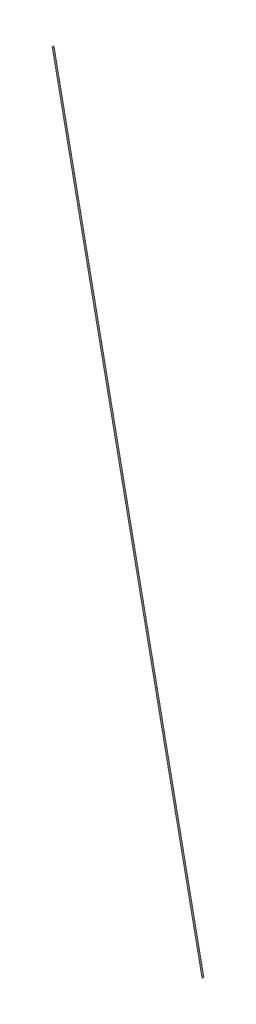
ISO-10303-21;
HEADER;
FILE_DESCRIPTION(('STEP AP214'),'2;1');
FILE_NAME('part.step','',(''),(''),'','','');
FILE_SCHEMA(('AUTOMOTIVE_DESIGN { 1 0 10303 214 1 1 1 1 }'));
ENDSEC;
DATA;
#1=APPLICATION_CONTEXT('core data for automotive mechanical design processes');
#2=APPLICATION_PROTOCOL_DEFINITION('international standard','automotive_design',2000,#1);
#3=PRODUCT_CONTEXT('',#1,'mechanical');
#4=PRODUCT('Part','Part','',(#3));
#5=PRODUCT_RELATED_PRODUCT_CATEGORY('part','',(#4));
#6=PRODUCT_DEFINITION_FORMATION('','',#4);
#7=PRODUCT_DEFINITION_CONTEXT('part definition',#1,'design');
#8=PRODUCT_DEFINITION('design','',#6,#7);
#9=PRODUCT_DEFINITION_SHAPE('','',#8);
#10=(LENGTH_UNIT() NAMED_UNIT(*) SI_UNIT(.MILLI.,.METRE.));
#11=(NAMED_UNIT(*) PLANE_ANGLE_UNIT() SI_UNIT($,.RADIAN.));
#12=(NAMED_UNIT(*) SI_UNIT($,.STERADIAN.) SOLID_ANGLE_UNIT());
#13=UNCERTAINTY_MEASURE_WITH_UNIT(LENGTH_MEASURE(1.E-05),#10,'distance_accuracy_value','');
#14=(GEOMETRIC_REPRESENTATION_CONTEXT(3) GLOBAL_UNCERTAINTY_ASSIGNED_CONTEXT((#13)) GLOBAL_UNIT_ASSIGNED_CONTEXT((#10,
#11,#12)) REPRESENTATION_CONTEXT('',''));
#15=CARTESIAN_POINT('',(0.,0.,0.));
#16=DIRECTION('',(0.,0.,1.));
#17=DIRECTION('',(1.,0.,0.));
#18=AXIS2_PLACEMENT_3D('',#15,#16,#17);
#19=CARTESIAN_POINT('',(0.,6.66133814775094E-13,-217.5));
#20=DIRECTION('',(0.,0.98585515914511,0.16759953814665));
#21=DIRECTION('',(0.,-0.16759953814665,0.98585515914511));
#22=AXIS2_PLACEMENT_3D('',#19,#20,#21);
#23=PLANE('',#22);
#24=CARTESIAN_POINT('',(0.,6.66133814775094E-13,-217.5));
#25=DIRECTION('',(0.,0.98585515914511,0.16759953814665));
#26=DIRECTION('',(0.,-0.16759953814665,0.98585515914511));
#27=AXIS2_PLACEMENT_3D('',#24,#25,#26);
#28=CIRCLE('',#27,0.999999999999999);
#29=CARTESIAN_POINT('',(0.,-0.167599538145984,-216.514144840855));
#30=VERTEX_POINT('',#29);
#31=EDGE_CURVE('E44',#30,#30,#28,.T.);
#32=ORIENTED_EDGE('',*,*,#31,.F.);
#33=EDGE_LOOP('',(#32));
#34=FACE_BOUND('',#33,.T.);
#35=ADVANCED_FACE('F37',(#34),#23,.F.);
#36=CARTESIAN_POINT('',(0.,1279.38,0.));
#37=DIRECTION('',(0.,0.98585515914511,0.16759953814665));
#38=DIRECTION('',(0.,-0.16759953814665,0.98585515914511));
#39=AXIS2_PLACEMENT_3D('',#36,#37,#38);
#40=PLANE('',#39);
#41=CARTESIAN_POINT('',(0.,1279.38,0.));
#42=DIRECTION('',(0.,0.98585515914511,0.16759953814665));
#43=DIRECTION('',(0.,-0.16759953814665,0.98585515914511));
#44=AXIS2_PLACEMENT_3D('',#41,#42,#43);
#45=CIRCLE('',#44,0.999999999999999);
#46=CARTESIAN_POINT('',(0.,1279.21240046185,0.98585515914508));
#47=VERTEX_POINT('',#46);
#48=EDGE_CURVE('E10',#47,#47,#45,.T.);
#49=ORIENTED_EDGE('',*,*,#48,.T.);
#50=EDGE_LOOP('',(#49));
#51=FACE_BOUND('',#50,.T.);
#52=ADVANCED_FACE('F54',(#51),#40,.T.);
#53=CARTESIAN_POINT('',(0.,6.66133814775094E-13,-217.5));
#54=DIRECTION('',(0.,0.98585515914511,0.16759953814665));
#55=DIRECTION('',(0.,-0.16759953814665,0.98585515914511));
#56=AXIS2_PLACEMENT_3D('',#53,#54,#55);
#57=CYLINDRICAL_SURFACE('',#56,0.999999999999999);
#58=ORIENTED_EDGE('',*,*,#48,.F.);
#59=EDGE_LOOP('',(#58));
#60=FACE_BOUND('',#59,.T.);
#61=ORIENTED_EDGE('',*,*,#31,.T.);
#62=EDGE_LOOP('',(#61));
#63=FACE_BOUND('',#62,.T.);
#64=ADVANCED_FACE('F51',(#60,#63),#57,.T.);
#65=CLOSED_SHELL('',(#35,#52,#64));
#66=MANIFOLD_SOLID_BREP('B2',#65);
#67=ADVANCED_BREP_SHAPE_REPRESENTATION('',(#18,#66),#14);
#68=SHAPE_DEFINITION_REPRESENTATION(#9,#67);
ENDSEC;
END-ISO-10303-21;
